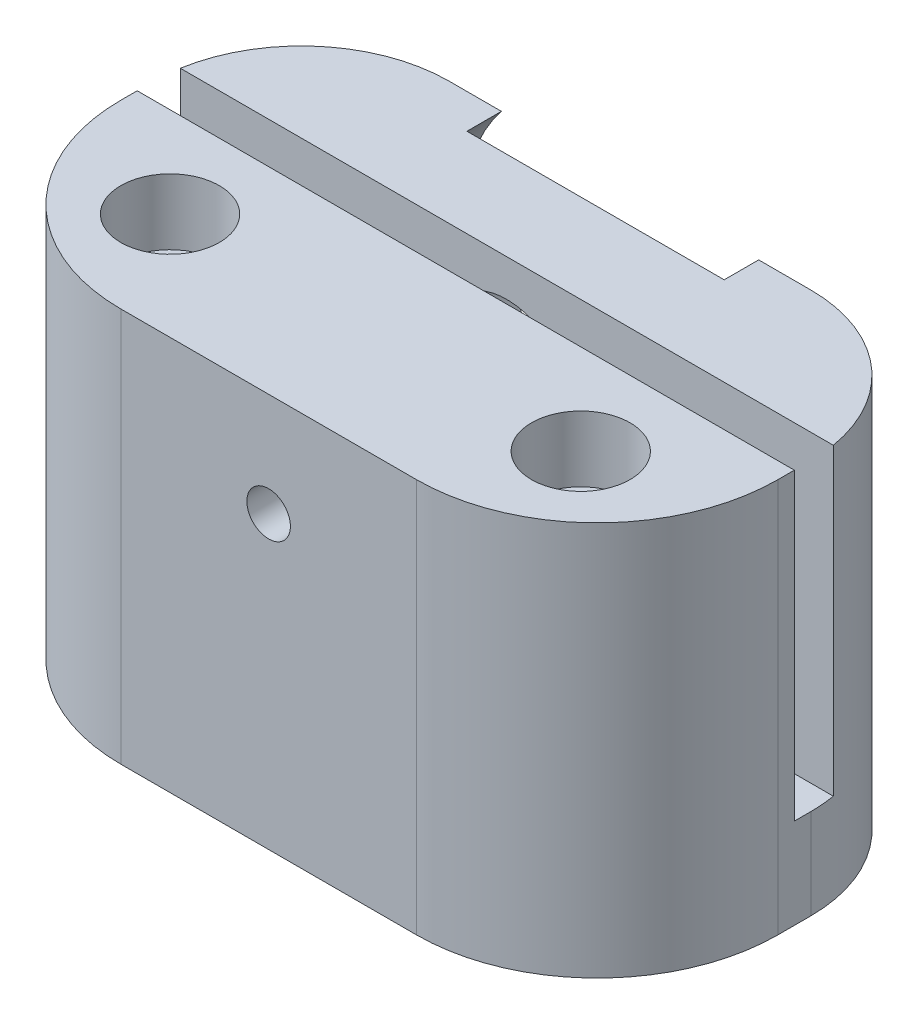
ISO-10303-21;
HEADER;
FILE_DESCRIPTION(('STEP AP214'),'2;1');
FILE_NAME('part.step','',(''),(''),'','','');
FILE_SCHEMA(('AUTOMOTIVE_DESIGN { 1 0 10303 214 1 1 1 1 }'));
ENDSEC;
DATA;
#1=APPLICATION_CONTEXT('core data for automotive mechanical design processes');
#2=APPLICATION_PROTOCOL_DEFINITION('international standard','automotive_design',2000,#1);
#3=PRODUCT_CONTEXT('',#1,'mechanical');
#4=PRODUCT('Part','Part','',(#3));
#5=PRODUCT_RELATED_PRODUCT_CATEGORY('part','',(#4));
#6=PRODUCT_DEFINITION_FORMATION('','',#4);
#7=PRODUCT_DEFINITION_CONTEXT('part definition',#1,'design');
#8=PRODUCT_DEFINITION('design','',#6,#7);
#9=PRODUCT_DEFINITION_SHAPE('','',#8);
#10=(LENGTH_UNIT() NAMED_UNIT(*) SI_UNIT(.MILLI.,.METRE.));
#11=(NAMED_UNIT(*) PLANE_ANGLE_UNIT() SI_UNIT($,.RADIAN.));
#12=(NAMED_UNIT(*) SI_UNIT($,.STERADIAN.) SOLID_ANGLE_UNIT());
#13=UNCERTAINTY_MEASURE_WITH_UNIT(LENGTH_MEASURE(1.E-05),#10,'distance_accuracy_value','');
#14=(GEOMETRIC_REPRESENTATION_CONTEXT(3) GLOBAL_UNCERTAINTY_ASSIGNED_CONTEXT((#13)) GLOBAL_UNIT_ASSIGNED_CONTEXT((#10,
#11,#12)) REPRESENTATION_CONTEXT('',''));
#15=CARTESIAN_POINT('',(0.,0.,0.));
#16=DIRECTION('',(0.,0.,1.));
#17=DIRECTION('',(1.,0.,0.));
#18=AXIS2_PLACEMENT_3D('',#15,#16,#17);
#19=CARTESIAN_POINT('',(20.,17.7,-16.5));
#20=DIRECTION('',(0.,0.,-1.));
#21=DIRECTION('',(-1.,0.,0.));
#22=AXIS2_PLACEMENT_3D('',#19,#20,#21);
#23=CYLINDRICAL_SURFACE('',#22,4.8);
#24=CARTESIAN_POINT('',(20.,17.7,-16.5));
#25=DIRECTION('',(0.,0.,-1.));
#26=DIRECTION('',(-1.,0.,0.));
#27=AXIS2_PLACEMENT_3D('',#24,#25,#26);
#28=CIRCLE('',#27,4.8);
#29=CARTESIAN_POINT('',(15.2,17.7,-16.5));
#30=VERTEX_POINT('',#29);
#31=EDGE_CURVE('E240',#30,#30,#28,.T.);
#32=ORIENTED_EDGE('',*,*,#31,.F.);
#33=EDGE_LOOP('',(#32));
#34=FACE_BOUND('',#33,.T.);
#35=CARTESIAN_POINT('',(20.,17.7,-19.9));
#36=DIRECTION('',(0.,0.,-1.));
#37=DIRECTION('',(-1.,0.,0.));
#38=AXIS2_PLACEMENT_3D('',#35,#36,#37);
#39=CIRCLE('',#38,4.8);
#40=CARTESIAN_POINT('',(15.2,17.7,-19.9));
#41=VERTEX_POINT('',#40);
#42=EDGE_CURVE('E241',#41,#41,#39,.F.);
#43=ORIENTED_EDGE('',*,*,#42,.F.);
#44=EDGE_LOOP('',(#43));
#45=FACE_BOUND('',#44,.T.);
#46=ADVANCED_FACE('F37',(#34,#45),#23,.F.);
#47=CARTESIAN_POINT('',(20.,17.7,-29.));
#48=DIRECTION('',(0.,0.,1.));
#49=DIRECTION('',(1.,0.,0.));
#50=AXIS2_PLACEMENT_3D('',#47,#48,#49);
#51=CYLINDRICAL_SURFACE('',#50,4.05);
#52=CARTESIAN_POINT('',(20.,17.7,-14.5));
#53=DIRECTION('',(0.,0.,-1.));
#54=DIRECTION('',(-1.,0.,0.));
#55=AXIS2_PLACEMENT_3D('',#52,#53,#54);
#56=CIRCLE('',#55,4.05);
#57=CARTESIAN_POINT('',(15.95,17.7,-14.5));
#58=VERTEX_POINT('',#57);
#59=EDGE_CURVE('E233',#58,#58,#56,.F.);
#60=ORIENTED_EDGE('',*,*,#59,.T.);
#61=EDGE_LOOP('',(#60));
#62=FACE_BOUND('',#61,.T.);
#63=CARTESIAN_POINT('',(20.,17.7,-16.5));
#64=DIRECTION('',(0.,0.,-1.));
#65=DIRECTION('',(-1.,0.,0.));
#66=AXIS2_PLACEMENT_3D('',#63,#64,#65);
#67=CIRCLE('',#66,4.05);
#68=CARTESIAN_POINT('',(15.95,17.7,-16.5));
#69=VERTEX_POINT('',#68);
#70=EDGE_CURVE('E237',#69,#69,#67,.T.);
#71=ORIENTED_EDGE('',*,*,#70,.T.);
#72=EDGE_LOOP('',(#71));
#73=FACE_BOUND('',#72,.T.);
#74=ADVANCED_FACE('F336',(#62,#73),#51,.F.);
#75=CARTESIAN_POINT('',(40.,5.5,-22.));
#76=DIRECTION('',(0.,-1.,0.));
#77=DIRECTION('',(1.,0.,0.));
#78=AXIS2_PLACEMENT_3D('',#75,#76,#77);
#79=PLANE('',#78);
#80=DIRECTION('',(1.,0.,0.));
#81=VECTOR('',#80,1.);
#82=CARTESIAN_POINT('',(40.,5.5,-14.5));
#83=LINE('',#82,#81);
#84=CARTESIAN_POINT('',(0.125880325350576,5.5,-14.5));
#85=VERTEX_POINT('',#84);
#86=CARTESIAN_POINT('',(39.8741196746494,5.5,-14.5));
#87=VERTEX_POINT('',#86);
#88=EDGE_CURVE('E167',#85,#87,#83,.T.);
#89=ORIENTED_EDGE('',*,*,#88,.F.);
#90=CARTESIAN_POINT('',(9.,5.5,-13.));
#91=DIRECTION('',(0.,-1.,0.));
#92=DIRECTION('',(1.,0.,0.));
#93=AXIS2_PLACEMENT_3D('',#90,#91,#92);
#94=CIRCLE('',#93,9.);
#95=CARTESIAN_POINT('',(0.,5.5,-13.));
#96=VERTEX_POINT('',#95);
#97=EDGE_CURVE('E278',#85,#96,#94,.F.);
#98=ORIENTED_EDGE('',*,*,#97,.T.);
#99=DIRECTION('',(0.,0.,1.));
#100=VECTOR('',#99,1.);
#101=CARTESIAN_POINT('',(0.,5.5,-22.));
#102=LINE('',#101,#100);
#103=CARTESIAN_POINT('',(0.,5.5,-12.));
#104=VERTEX_POINT('',#103);
#105=EDGE_CURVE('E185',#96,#104,#102,.T.);
#106=ORIENTED_EDGE('',*,*,#105,.T.);
#107=DIRECTION('',(1.,0.,0.));
#108=VECTOR('',#107,1.);
#109=CARTESIAN_POINT('',(40.,5.5,-12.));
#110=LINE('',#109,#108);
#111=CARTESIAN_POINT('',(40.,5.5,-12.));
#112=VERTEX_POINT('',#111);
#113=EDGE_CURVE('E177',#104,#112,#110,.T.);
#114=ORIENTED_EDGE('',*,*,#113,.T.);
#115=DIRECTION('',(0.,0.,1.));
#116=VECTOR('',#115,1.);
#117=CARTESIAN_POINT('',(40.,5.5,-22.));
#118=LINE('',#117,#116);
#119=CARTESIAN_POINT('',(40.,5.5,-13.));
#120=VERTEX_POINT('',#119);
#121=EDGE_CURVE('E181',#120,#112,#118,.T.);
#122=ORIENTED_EDGE('',*,*,#121,.F.);
#123=CARTESIAN_POINT('',(31.,5.5,-13.));
#124=DIRECTION('',(0.,-1.,0.));
#125=DIRECTION('',(1.,0.,0.));
#126=AXIS2_PLACEMENT_3D('',#123,#124,#125);
#127=CIRCLE('',#126,9.);
#128=EDGE_CURVE('E276',#120,#87,#127,.F.);
#129=ORIENTED_EDGE('',*,*,#128,.T.);
#130=EDGE_LOOP('',(#89,#98,#106,#114,#122,#129));
#131=FACE_BOUND('',#130,.T.);
#132=ADVANCED_FACE('F302',(#131),#79,.F.);
#133=CARTESIAN_POINT('',(0.,24.,-12.));
#134=DIRECTION('',(0.,0.,1.));
#135=DIRECTION('',(1.,0.,0.));
#136=AXIS2_PLACEMENT_3D('',#133,#134,#135);
#137=PLANE('',#136);
#138=CARTESIAN_POINT('',(20.,17.7,-12.));
#139=DIRECTION('',(0.,0.,1.));
#140=DIRECTION('',(1.,0.,0.));
#141=AXIS2_PLACEMENT_3D('',#138,#139,#140);
#142=CIRCLE('',#141,4.05);
#143=CARTESIAN_POINT('',(24.05,17.7,-12.));
#144=VERTEX_POINT('',#143);
#145=EDGE_CURVE('E171',#144,#144,#142,.F.);
#146=ORIENTED_EDGE('',*,*,#145,.F.);
#147=EDGE_LOOP('',(#146));
#148=FACE_BOUND('',#147,.T.);
#149=ORIENTED_EDGE('',*,*,#113,.F.);
#150=DIRECTION('',(0.,-1.,0.));
#151=VECTOR('',#150,1.);
#152=CARTESIAN_POINT('',(0.,24.,-12.));
#153=LINE('',#152,#151);
#154=CARTESIAN_POINT('',(0.,24.,-12.));
#155=VERTEX_POINT('',#154);
#156=EDGE_CURVE('E218',#155,#104,#153,.T.);
#157=ORIENTED_EDGE('',*,*,#156,.F.);
#158=DIRECTION('',(-1.,0.,0.));
#159=VECTOR('',#158,1.);
#160=CARTESIAN_POINT('',(0.,24.,-12.));
#161=LINE('',#160,#159);
#162=CARTESIAN_POINT('',(40.,24.,-12.));
#163=VERTEX_POINT('',#162);
#164=EDGE_CURVE('E216',#163,#155,#161,.T.);
#165=ORIENTED_EDGE('',*,*,#164,.F.);
#166=DIRECTION('',(0.,-1.,0.));
#167=VECTOR('',#166,1.);
#168=CARTESIAN_POINT('',(40.,24.,-12.));
#169=LINE('',#168,#167);
#170=EDGE_CURVE('E159',#163,#112,#169,.T.);
#171=ORIENTED_EDGE('',*,*,#170,.T.);
#172=EDGE_LOOP('',(#149,#157,#165,#171));
#173=FACE_BOUND('',#172,.T.);
#174=ADVANCED_FACE('F306',(#148,#173),#137,.F.);
#175=CARTESIAN_POINT('',(0.,24.,0.));
#176=DIRECTION('',(1.,0.,0.));
#177=DIRECTION('',(0.,0.,-1.));
#178=AXIS2_PLACEMENT_3D('',#175,#176,#177);
#179=PLANE('',#178);
#180=ORIENTED_EDGE('',*,*,#105,.F.);
#181=DIRECTION('',(0.,1.,0.));
#182=VECTOR('',#181,1.);
#183=CARTESIAN_POINT('',(0.,24.,-13.));
#184=LINE('',#183,#182);
#185=CARTESIAN_POINT('',(0.,0.,-13.));
#186=VERTEX_POINT('',#185);
#187=EDGE_CURVE('E60',#96,#186,#184,.F.);
#188=ORIENTED_EDGE('',*,*,#187,.T.);
#189=DIRECTION('',(0.,0.,1.));
#190=VECTOR('',#189,1.);
#191=CARTESIAN_POINT('',(0.,0.,0.));
#192=LINE('',#191,#190);
#193=CARTESIAN_POINT('',(0.,0.,-11.));
#194=VERTEX_POINT('',#193);
#195=EDGE_CURVE('E219',#186,#194,#192,.T.);
#196=ORIENTED_EDGE('',*,*,#195,.T.);
#197=DIRECTION('',(0.,-1.,0.));
#198=VECTOR('',#197,1.);
#199=CARTESIAN_POINT('',(0.,24.,-11.));
#200=LINE('',#199,#198);
#201=CARTESIAN_POINT('',(0.,24.,-11.));
#202=VERTEX_POINT('',#201);
#203=EDGE_CURVE('E255',#194,#202,#200,.F.);
#204=ORIENTED_EDGE('',*,*,#203,.T.);
#205=DIRECTION('',(0.,0.,1.));
#206=VECTOR('',#205,1.);
#207=CARTESIAN_POINT('',(0.,24.,0.));
#208=LINE('',#207,#206);
#209=EDGE_CURVE('E207',#155,#202,#208,.T.);
#210=ORIENTED_EDGE('',*,*,#209,.F.);
#211=ORIENTED_EDGE('',*,*,#156,.T.);
#212=EDGE_LOOP('',(#180,#188,#196,#204,#210,#211));
#213=FACE_BOUND('',#212,.T.);
#214=ADVANCED_FACE('F309',(#213),#179,.F.);
#215=CARTESIAN_POINT('',(0.,24.,0.));
#216=DIRECTION('',(0.,0.,-1.));
#217=DIRECTION('',(-1.,0.,0.));
#218=AXIS2_PLACEMENT_3D('',#215,#216,#217);
#219=PLANE('',#218);
#220=CARTESIAN_POINT('',(20.,17.7,0.));
#221=DIRECTION('',(0.,0.,-1.));
#222=DIRECTION('',(-1.,0.,0.));
#223=AXIS2_PLACEMENT_3D('',#220,#221,#222);
#224=CIRCLE('',#223,1.325);
#225=CARTESIAN_POINT('',(18.675,17.7,0.));
#226=VERTEX_POINT('',#225);
#227=EDGE_CURVE('E152',#226,#226,#224,.T.);
#228=ORIENTED_EDGE('',*,*,#227,.T.);
#229=EDGE_LOOP('',(#228));
#230=FACE_BOUND('',#229,.T.);
#231=DIRECTION('',(1.,0.,0.));
#232=VECTOR('',#231,1.);
#233=CARTESIAN_POINT('',(0.,24.,0.));
#234=LINE('',#233,#232);
#235=CARTESIAN_POINT('',(11.,24.,0.));
#236=VERTEX_POINT('',#235);
#237=CARTESIAN_POINT('',(29.,24.,0.));
#238=VERTEX_POINT('',#237);
#239=EDGE_CURVE('E210',#236,#238,#234,.T.);
#240=ORIENTED_EDGE('',*,*,#239,.F.);
#241=DIRECTION('',(0.,-1.,0.));
#242=VECTOR('',#241,1.);
#243=CARTESIAN_POINT('',(11.,24.,0.));
#244=LINE('',#243,#242);
#245=CARTESIAN_POINT('',(11.,0.,0.));
#246=VERTEX_POINT('',#245);
#247=EDGE_CURVE('E247',#236,#246,#244,.T.);
#248=ORIENTED_EDGE('',*,*,#247,.T.);
#249=DIRECTION('',(1.,0.,0.));
#250=VECTOR('',#249,1.);
#251=CARTESIAN_POINT('',(0.,0.,0.));
#252=LINE('',#251,#250);
#253=CARTESIAN_POINT('',(29.,0.,0.));
#254=VERTEX_POINT('',#253);
#255=EDGE_CURVE('E221',#246,#254,#252,.T.);
#256=ORIENTED_EDGE('',*,*,#255,.T.);
#257=DIRECTION('',(0.,-1.,0.));
#258=VECTOR('',#257,1.);
#259=CARTESIAN_POINT('',(29.,24.,0.));
#260=LINE('',#259,#258);
#261=EDGE_CURVE('E245',#254,#238,#260,.F.);
#262=ORIENTED_EDGE('',*,*,#261,.T.);
#263=EDGE_LOOP('',(#240,#248,#256,#262));
#264=FACE_BOUND('',#263,.T.);
#265=ADVANCED_FACE('F320',(#230,#264),#219,.F.);
#266=CARTESIAN_POINT('',(40.,24.,0.));
#267=DIRECTION('',(-1.,0.,0.));
#268=DIRECTION('',(0.,0.,1.));
#269=AXIS2_PLACEMENT_3D('',#266,#267,#268);
#270=PLANE('',#269);
#271=DIRECTION('',(0.,0.,-1.));
#272=VECTOR('',#271,1.);
#273=CARTESIAN_POINT('',(40.,0.,0.));
#274=LINE('',#273,#272);
#275=CARTESIAN_POINT('',(40.,0.,-11.));
#276=VERTEX_POINT('',#275);
#277=CARTESIAN_POINT('',(40.,0.,-13.));
#278=VERTEX_POINT('',#277);
#279=EDGE_CURVE('E211',#276,#278,#274,.T.);
#280=ORIENTED_EDGE('',*,*,#279,.T.);
#281=DIRECTION('',(0.,-1.,0.));
#282=VECTOR('',#281,1.);
#283=CARTESIAN_POINT('',(40.,24.,-13.));
#284=LINE('',#283,#282);
#285=EDGE_CURVE('E12',#278,#120,#284,.F.);
#286=ORIENTED_EDGE('',*,*,#285,.T.);
#287=ORIENTED_EDGE('',*,*,#121,.T.);
#288=ORIENTED_EDGE('',*,*,#170,.F.);
#289=DIRECTION('',(0.,0.,-1.));
#290=VECTOR('',#289,1.);
#291=CARTESIAN_POINT('',(40.,24.,0.));
#292=LINE('',#291,#290);
#293=CARTESIAN_POINT('',(40.,24.,-11.));
#294=VERTEX_POINT('',#293);
#295=EDGE_CURVE('E214',#294,#163,#292,.T.);
#296=ORIENTED_EDGE('',*,*,#295,.F.);
#297=DIRECTION('',(0.,-1.,0.));
#298=VECTOR('',#297,1.);
#299=CARTESIAN_POINT('',(40.,24.,-11.));
#300=LINE('',#299,#298);
#301=EDGE_CURVE('E261',#294,#276,#300,.T.);
#302=ORIENTED_EDGE('',*,*,#301,.T.);
#303=EDGE_LOOP('',(#280,#286,#287,#288,#296,#302));
#304=FACE_BOUND('',#303,.T.);
#305=ADVANCED_FACE('F299',(#304),#270,.F.);
#306=CARTESIAN_POINT('',(0.,24.,0.));
#307=DIRECTION('',(0.,-1.,0.));
#308=DIRECTION('',(0.,0.,-1.));
#309=AXIS2_PLACEMENT_3D('',#306,#307,#308);
#310=PLANE('',#309);
#311=CARTESIAN_POINT('',(7.5,24.,-6.5));
#312=DIRECTION('',(0.,1.,0.));
#313=DIRECTION('',(0.,0.,1.));
#314=AXIS2_PLACEMENT_3D('',#311,#312,#313);
#315=CIRCLE('',#314,3.);
#316=CARTESIAN_POINT('',(7.5,24.,-3.5));
#317=VERTEX_POINT('',#316);
#318=EDGE_CURVE('E187',#317,#317,#315,.T.);
#319=ORIENTED_EDGE('',*,*,#318,.F.);
#320=EDGE_LOOP('',(#319));
#321=FACE_BOUND('',#320,.T.);
#322=CARTESIAN_POINT('',(32.5,24.,-6.5));
#323=DIRECTION('',(0.,1.,0.));
#324=DIRECTION('',(0.,0.,1.));
#325=AXIS2_PLACEMENT_3D('',#322,#323,#324);
#326=CIRCLE('',#325,3.);
#327=CARTESIAN_POINT('',(32.5,24.,-3.5));
#328=VERTEX_POINT('',#327);
#329=EDGE_CURVE('E197',#328,#328,#326,.T.);
#330=ORIENTED_EDGE('',*,*,#329,.F.);
#331=EDGE_LOOP('',(#330));
#332=FACE_BOUND('',#331,.T.);
#333=ORIENTED_EDGE('',*,*,#209,.T.);
#334=CARTESIAN_POINT('',(11.,24.,-11.));
#335=DIRECTION('',(0.,-1.,0.));
#336=DIRECTION('',(0.,0.,-1.));
#337=AXIS2_PLACEMENT_3D('',#334,#335,#336);
#338=CIRCLE('',#337,11.);
#339=EDGE_CURVE('E259',#202,#236,#338,.F.);
#340=ORIENTED_EDGE('',*,*,#339,.T.);
#341=ORIENTED_EDGE('',*,*,#239,.T.);
#342=CARTESIAN_POINT('',(29.,24.,-11.));
#343=DIRECTION('',(0.,-1.,0.));
#344=DIRECTION('',(0.,0.,-1.));
#345=AXIS2_PLACEMENT_3D('',#342,#343,#344);
#346=CIRCLE('',#345,11.);
#347=EDGE_CURVE('E257',#238,#294,#346,.F.);
#348=ORIENTED_EDGE('',*,*,#347,.T.);
#349=ORIENTED_EDGE('',*,*,#295,.T.);
#350=ORIENTED_EDGE('',*,*,#164,.T.);
#351=EDGE_LOOP('',(#333,#340,#341,#348,#349,#350));
#352=FACE_BOUND('',#351,.T.);
#353=ADVANCED_FACE('F313',(#321,#332,#352),#310,.F.);
#354=CARTESIAN_POINT('',(0.,0.,0.));
#355=DIRECTION('',(0.,-1.,0.));
#356=DIRECTION('',(0.,0.,-1.));
#357=AXIS2_PLACEMENT_3D('',#354,#355,#356);
#358=PLANE('',#357);
#359=CARTESIAN_POINT('',(7.5,0.,-6.5));
#360=DIRECTION('',(0.,-1.,0.));
#361=DIRECTION('',(0.,0.,-1.));
#362=AXIS2_PLACEMENT_3D('',#359,#360,#361);
#363=CIRCLE('',#362,1.49999999999999);
#364=CARTESIAN_POINT('',(7.5,0.,-7.99999999999999));
#365=VERTEX_POINT('',#364);
#366=EDGE_CURVE('E196',#365,#365,#363,.T.);
#367=ORIENTED_EDGE('',*,*,#366,.F.);
#368=EDGE_LOOP('',(#367));
#369=FACE_BOUND('',#368,.T.);
#370=CARTESIAN_POINT('',(32.5,0.,-6.5));
#371=DIRECTION('',(0.,-1.,0.));
#372=DIRECTION('',(0.,0.,-1.));
#373=AXIS2_PLACEMENT_3D('',#370,#371,#372);
#374=CIRCLE('',#373,1.49999999999999);
#375=CARTESIAN_POINT('',(32.5,0.,-7.99999999999999));
#376=VERTEX_POINT('',#375);
#377=EDGE_CURVE('E206',#376,#376,#374,.T.);
#378=ORIENTED_EDGE('',*,*,#377,.F.);
#379=EDGE_LOOP('',(#378));
#380=FACE_BOUND('',#379,.T.);
#381=ORIENTED_EDGE('',*,*,#195,.F.);
#382=CARTESIAN_POINT('',(9.,0.,-13.));
#383=DIRECTION('',(0.,-1.,0.));
#384=DIRECTION('',(0.,0.,-1.));
#385=AXIS2_PLACEMENT_3D('',#382,#383,#384);
#386=CIRCLE('',#385,9.);
#387=CARTESIAN_POINT('',(9.,0.,-22.));
#388=VERTEX_POINT('',#387);
#389=EDGE_CURVE('E45',#186,#388,#386,.T.);
#390=ORIENTED_EDGE('',*,*,#389,.T.);
#391=DIRECTION('',(-1.,0.,0.));
#392=VECTOR('',#391,1.);
#393=CARTESIAN_POINT('',(40.,0.,-22.));
#394=LINE('',#393,#392);
#395=CARTESIAN_POINT('',(31.,0.,-22.));
#396=VERTEX_POINT('',#395);
#397=EDGE_CURVE('E179',#396,#388,#394,.T.);
#398=ORIENTED_EDGE('',*,*,#397,.F.);
#399=CARTESIAN_POINT('',(31.,0.,-13.));
#400=DIRECTION('',(0.,-1.,0.));
#401=DIRECTION('',(0.,0.,-1.));
#402=AXIS2_PLACEMENT_3D('',#399,#400,#401);
#403=CIRCLE('',#402,9.);
#404=EDGE_CURVE('E52',#396,#278,#403,.T.);
#405=ORIENTED_EDGE('',*,*,#404,.T.);
#406=ORIENTED_EDGE('',*,*,#279,.F.);
#407=CARTESIAN_POINT('',(29.,0.,-11.));
#408=DIRECTION('',(0.,-1.,0.));
#409=DIRECTION('',(0.,0.,-1.));
#410=AXIS2_PLACEMENT_3D('',#407,#408,#409);
#411=CIRCLE('',#410,11.);
#412=EDGE_CURVE('E250',#276,#254,#411,.T.);
#413=ORIENTED_EDGE('',*,*,#412,.T.);
#414=ORIENTED_EDGE('',*,*,#255,.F.);
#415=CARTESIAN_POINT('',(11.,0.,-11.));
#416=DIRECTION('',(0.,-1.,0.));
#417=DIRECTION('',(0.,0.,-1.));
#418=AXIS2_PLACEMENT_3D('',#415,#416,#417);
#419=CIRCLE('',#418,11.);
#420=EDGE_CURVE('E252',#246,#194,#419,.T.);
#421=ORIENTED_EDGE('',*,*,#420,.T.);
#422=EDGE_LOOP('',(#381,#390,#398,#405,#406,#413,#414,#421));
#423=FACE_BOUND('',#422,.T.);
#424=ADVANCED_FACE('F282',(#369,#380,#423),#358,.T.);
#425=CARTESIAN_POINT('',(32.5,24.,-6.5));
#426=DIRECTION('',(0.,1.,0.));
#427=DIRECTION('',(0.,0.,1.));
#428=AXIS2_PLACEMENT_3D('',#425,#426,#427);
#429=CYLINDRICAL_SURFACE('',#428,1.49999999999999);
#430=ORIENTED_EDGE('',*,*,#377,.T.);
#431=EDGE_LOOP('',(#430));
#432=FACE_BOUND('',#431,.T.);
#433=CARTESIAN_POINT('',(32.5,20.,-6.5));
#434=DIRECTION('',(0.,1.,0.));
#435=DIRECTION('',(0.,0.,1.));
#436=AXIS2_PLACEMENT_3D('',#433,#434,#435);
#437=CIRCLE('',#436,1.49999999999999);
#438=CARTESIAN_POINT('',(32.5,20.,-5.00000000000001));
#439=VERTEX_POINT('',#438);
#440=EDGE_CURVE('E203',#439,#439,#437,.T.);
#441=ORIENTED_EDGE('',*,*,#440,.T.);
#442=EDGE_LOOP('',(#441));
#443=FACE_BOUND('',#442,.T.);
#444=ADVANCED_FACE('F385',(#432,#443),#429,.F.);
#445=CARTESIAN_POINT('',(34.,20.,-6.5));
#446=DIRECTION('',(0.,-1.,0.));
#447=DIRECTION('',(0.,0.,-1.));
#448=AXIS2_PLACEMENT_3D('',#445,#446,#447);
#449=PLANE('',#448);
#450=ORIENTED_EDGE('',*,*,#440,.F.);
#451=EDGE_LOOP('',(#450));
#452=FACE_BOUND('',#451,.T.);
#453=CARTESIAN_POINT('',(32.5,20.,-6.5));
#454=DIRECTION('',(0.,1.,0.));
#455=DIRECTION('',(0.,0.,1.));
#456=AXIS2_PLACEMENT_3D('',#453,#454,#455);
#457=CIRCLE('',#456,3.);
#458=CARTESIAN_POINT('',(32.5,20.,-3.5));
#459=VERTEX_POINT('',#458);
#460=EDGE_CURVE('E200',#459,#459,#457,.T.);
#461=ORIENTED_EDGE('',*,*,#460,.T.);
#462=EDGE_LOOP('',(#461));
#463=FACE_BOUND('',#462,.T.);
#464=ADVANCED_FACE('F381',(#452,#463),#449,.F.);
#465=CARTESIAN_POINT('',(32.5,24.,-6.5));
#466=DIRECTION('',(0.,1.,0.));
#467=DIRECTION('',(0.,0.,1.));
#468=AXIS2_PLACEMENT_3D('',#465,#466,#467);
#469=CYLINDRICAL_SURFACE('',#468,3.);
#470=ORIENTED_EDGE('',*,*,#460,.F.);
#471=EDGE_LOOP('',(#470));
#472=FACE_BOUND('',#471,.T.);
#473=ORIENTED_EDGE('',*,*,#329,.T.);
#474=EDGE_LOOP('',(#473));
#475=FACE_BOUND('',#474,.T.);
#476=ADVANCED_FACE('F377',(#472,#475),#469,.F.);
#477=CARTESIAN_POINT('',(7.5,24.,-6.5));
#478=DIRECTION('',(0.,1.,0.));
#479=DIRECTION('',(0.,0.,1.));
#480=AXIS2_PLACEMENT_3D('',#477,#478,#479);
#481=CYLINDRICAL_SURFACE('',#480,1.49999999999999);
#482=ORIENTED_EDGE('',*,*,#366,.T.);
#483=EDGE_LOOP('',(#482));
#484=FACE_BOUND('',#483,.T.);
#485=CARTESIAN_POINT('',(7.5,20.,-6.5));
#486=DIRECTION('',(0.,1.,0.));
#487=DIRECTION('',(0.,0.,1.));
#488=AXIS2_PLACEMENT_3D('',#485,#486,#487);
#489=CIRCLE('',#488,1.49999999999999);
#490=CARTESIAN_POINT('',(7.5,20.,-5.00000000000001));
#491=VERTEX_POINT('',#490);
#492=EDGE_CURVE('E193',#491,#491,#489,.T.);
#493=ORIENTED_EDGE('',*,*,#492,.T.);
#494=EDGE_LOOP('',(#493));
#495=FACE_BOUND('',#494,.T.);
#496=ADVANCED_FACE('F373',(#484,#495),#481,.F.);
#497=CARTESIAN_POINT('',(8.99999999999999,20.,-6.5));
#498=DIRECTION('',(0.,-1.,0.));
#499=DIRECTION('',(0.,0.,-1.));
#500=AXIS2_PLACEMENT_3D('',#497,#498,#499);
#501=PLANE('',#500);
#502=ORIENTED_EDGE('',*,*,#492,.F.);
#503=EDGE_LOOP('',(#502));
#504=FACE_BOUND('',#503,.T.);
#505=CARTESIAN_POINT('',(7.5,20.,-6.5));
#506=DIRECTION('',(0.,1.,0.));
#507=DIRECTION('',(0.,0.,1.));
#508=AXIS2_PLACEMENT_3D('',#505,#506,#507);
#509=CIRCLE('',#508,3.);
#510=CARTESIAN_POINT('',(7.5,20.,-3.5));
#511=VERTEX_POINT('',#510);
#512=EDGE_CURVE('E190',#511,#511,#509,.T.);
#513=ORIENTED_EDGE('',*,*,#512,.T.);
#514=EDGE_LOOP('',(#513));
#515=FACE_BOUND('',#514,.T.);
#516=ADVANCED_FACE('F369',(#504,#515),#501,.F.);
#517=CARTESIAN_POINT('',(7.5,24.,-6.5));
#518=DIRECTION('',(0.,1.,0.));
#519=DIRECTION('',(0.,0.,1.));
#520=AXIS2_PLACEMENT_3D('',#517,#518,#519);
#521=CYLINDRICAL_SURFACE('',#520,3.);
#522=ORIENTED_EDGE('',*,*,#512,.F.);
#523=EDGE_LOOP('',(#522));
#524=FACE_BOUND('',#523,.T.);
#525=ORIENTED_EDGE('',*,*,#318,.T.);
#526=EDGE_LOOP('',(#525));
#527=FACE_BOUND('',#526,.T.);
#528=ADVANCED_FACE('F364',(#524,#527),#521,.F.);
#529=CARTESIAN_POINT('',(0.,0.,-22.));
#530=DIRECTION('',(0.,0.,1.));
#531=DIRECTION('',(1.,0.,0.));
#532=AXIS2_PLACEMENT_3D('',#529,#530,#531);
#533=PLANE('',#532);
#534=ORIENTED_EDGE('',*,*,#397,.T.);
#535=DIRECTION('',(0.,1.,0.));
#536=VECTOR('',#535,1.);
#537=CARTESIAN_POINT('',(9.,0.,-22.));
#538=LINE('',#537,#536);
#539=CARTESIAN_POINT('',(9.,24.,-22.));
#540=VERTEX_POINT('',#539);
#541=EDGE_CURVE('E165',#388,#540,#538,.T.);
#542=ORIENTED_EDGE('',*,*,#541,.T.);
#543=DIRECTION('',(-1.,0.,0.));
#544=VECTOR('',#543,1.);
#545=CARTESIAN_POINT('',(40.,24.,-22.));
#546=LINE('',#545,#544);
#547=CARTESIAN_POINT('',(12.1697701183171,24.,-22.));
#548=VERTEX_POINT('',#547);
#549=EDGE_CURVE('E157',#548,#540,#546,.T.);
#550=ORIENTED_EDGE('',*,*,#549,.F.);
#551=CARTESIAN_POINT('',(20.,17.7,-22.));
#552=DIRECTION('',(0.,0.,-1.));
#553=DIRECTION('',(-1.,0.,0.));
#554=AXIS2_PLACEMENT_3D('',#551,#552,#553);
#555=CIRCLE('',#554,10.05);
#556=CARTESIAN_POINT('',(27.8302298816829,24.,-22.));
#557=VERTEX_POINT('',#556);
#558=EDGE_CURVE('E140',#557,#548,#555,.T.);
#559=ORIENTED_EDGE('',*,*,#558,.F.);
#560=CARTESIAN_POINT('',(31.,24.,-22.));
#561=VERTEX_POINT('',#560);
#562=EDGE_CURVE('E166',#561,#557,#546,.T.);
#563=ORIENTED_EDGE('',*,*,#562,.F.);
#564=DIRECTION('',(0.,-1.,0.));
#565=VECTOR('',#564,1.);
#566=CARTESIAN_POINT('',(31.,0.,-22.));
#567=LINE('',#566,#565);
#568=EDGE_CURVE('E264',#561,#396,#567,.T.);
#569=ORIENTED_EDGE('',*,*,#568,.T.);
#570=EDGE_LOOP('',(#534,#542,#550,#559,#563,#569));
#571=FACE_BOUND('',#570,.T.);
#572=ADVANCED_FACE('F163',(#571),#533,.F.);
#573=CARTESIAN_POINT('',(40.,24.,-14.5));
#574=DIRECTION('',(0.,0.,-1.));
#575=DIRECTION('',(-1.,0.,0.));
#576=AXIS2_PLACEMENT_3D('',#573,#574,#575);
#577=PLANE('',#576);
#578=ORIENTED_EDGE('',*,*,#59,.F.);
#579=EDGE_LOOP('',(#578));
#580=FACE_BOUND('',#579,.T.);
#581=DIRECTION('',(1.,0.,0.));
#582=VECTOR('',#581,1.);
#583=CARTESIAN_POINT('',(40.,24.,-14.5));
#584=LINE('',#583,#582);
#585=CARTESIAN_POINT('',(0.125880325350582,24.,-14.5));
#586=VERTEX_POINT('',#585);
#587=CARTESIAN_POINT('',(39.8741196746494,24.,-14.5));
#588=VERTEX_POINT('',#587);
#589=EDGE_CURVE('E169',#586,#588,#584,.T.);
#590=ORIENTED_EDGE('',*,*,#589,.F.);
#591=DIRECTION('',(0.,1.,0.));
#592=VECTOR('',#591,1.);
#593=CARTESIAN_POINT('',(0.125880325350578,24.,-14.5));
#594=LINE('',#593,#592);
#595=EDGE_CURVE('E274',#586,#85,#594,.F.);
#596=ORIENTED_EDGE('',*,*,#595,.T.);
#597=ORIENTED_EDGE('',*,*,#88,.T.);
#598=DIRECTION('',(0.,-1.,0.));
#599=VECTOR('',#598,1.);
#600=CARTESIAN_POINT('',(39.8741196746494,5.5,-14.5));
#601=LINE('',#600,#599);
#602=EDGE_CURVE('E272',#87,#588,#601,.F.);
#603=ORIENTED_EDGE('',*,*,#602,.T.);
#604=EDGE_LOOP('',(#590,#596,#597,#603));
#605=FACE_BOUND('',#604,.T.);
#606=ADVANCED_FACE('F291',(#580,#605),#577,.F.);
#607=CARTESIAN_POINT('',(0.,24.,0.));
#608=DIRECTION('',(0.,1.,0.));
#609=DIRECTION('',(-1.,0.,0.));
#610=AXIS2_PLACEMENT_3D('',#607,#608,#609);
#611=PLANE('',#610);
#612=ORIENTED_EDGE('',*,*,#549,.T.);
#613=CARTESIAN_POINT('',(9.,24.,-13.));
#614=DIRECTION('',(0.,1.,0.));
#615=DIRECTION('',(-1.,0.,0.));
#616=AXIS2_PLACEMENT_3D('',#613,#614,#615);
#617=CIRCLE('',#616,9.);
#618=EDGE_CURVE('E270',#540,#586,#617,.T.);
#619=ORIENTED_EDGE('',*,*,#618,.T.);
#620=ORIENTED_EDGE('',*,*,#589,.T.);
#621=CARTESIAN_POINT('',(31.,24.,-13.));
#622=DIRECTION('',(0.,1.,0.));
#623=DIRECTION('',(-1.,0.,0.));
#624=AXIS2_PLACEMENT_3D('',#621,#622,#623);
#625=CIRCLE('',#624,9.);
#626=EDGE_CURVE('E268',#588,#561,#625,.T.);
#627=ORIENTED_EDGE('',*,*,#626,.T.);
#628=ORIENTED_EDGE('',*,*,#562,.T.);
#629=DIRECTION('',(0.,0.,-1.));
#630=VECTOR('',#629,1.);
#631=CARTESIAN_POINT('',(27.8302298816829,24.,-19.9));
#632=LINE('',#631,#630);
#633=CARTESIAN_POINT('',(27.8302298816829,24.,-19.9));
#634=VERTEX_POINT('',#633);
#635=EDGE_CURVE('E147',#634,#557,#632,.T.);
#636=ORIENTED_EDGE('',*,*,#635,.F.);
#637=DIRECTION('',(-1.,0.,0.));
#638=VECTOR('',#637,1.);
#639=CARTESIAN_POINT('',(0.,24.,-19.9));
#640=LINE('',#639,#638);
#641=CARTESIAN_POINT('',(12.1697701183171,24.,-19.9));
#642=VERTEX_POINT('',#641);
#643=EDGE_CURVE('E158',#634,#642,#640,.T.);
#644=ORIENTED_EDGE('',*,*,#643,.T.);
#645=DIRECTION('',(0.,0.,-1.));
#646=VECTOR('',#645,1.);
#647=CARTESIAN_POINT('',(12.1697701183171,24.,-19.9));
#648=LINE('',#647,#646);
#649=EDGE_CURVE('E144',#548,#642,#648,.F.);
#650=ORIENTED_EDGE('',*,*,#649,.F.);
#651=EDGE_LOOP('',(#612,#619,#620,#627,#628,#636,#644,#650));
#652=FACE_BOUND('',#651,.T.);
#653=ADVANCED_FACE('F156',(#652),#611,.T.);
#654=CARTESIAN_POINT('',(20.,17.7,-6.));
#655=DIRECTION('',(0.,0.,-1.));
#656=DIRECTION('',(-1.,0.,0.));
#657=AXIS2_PLACEMENT_3D('',#654,#655,#656);
#658=CIRCLE('',#657,4.05);
#659=CARTESIAN_POINT('',(15.95,17.7,-6.));
#660=VERTEX_POINT('',#659);
#661=EDGE_CURVE('E236',#660,#660,#658,.T.);
#662=ORIENTED_EDGE('',*,*,#661,.F.);
#663=EDGE_LOOP('',(#662));
#664=FACE_BOUND('',#663,.T.);
#665=ORIENTED_EDGE('',*,*,#145,.T.);
#666=EDGE_LOOP('',(#665));
#667=FACE_BOUND('',#666,.T.);
#668=ADVANCED_FACE('F344',(#664,#667),#51,.F.);
#669=CARTESIAN_POINT('',(20.,17.7,-6.));
#670=DIRECTION('',(0.,0.,-1.));
#671=DIRECTION('',(-1.,0.,0.));
#672=AXIS2_PLACEMENT_3D('',#669,#670,#671);
#673=PLANE('',#672);
#674=CARTESIAN_POINT('',(20.,17.7,-6.));
#675=DIRECTION('',(0.,0.,-1.));
#676=DIRECTION('',(-1.,0.,0.));
#677=AXIS2_PLACEMENT_3D('',#674,#675,#676);
#678=CIRCLE('',#677,1.325);
#679=CARTESIAN_POINT('',(18.675,17.7,-6.));
#680=VERTEX_POINT('',#679);
#681=EDGE_CURVE('E627',#680,#680,#678,.T.);
#682=ORIENTED_EDGE('',*,*,#681,.F.);
#683=EDGE_LOOP('',(#682));
#684=FACE_BOUND('',#683,.T.);
#685=ORIENTED_EDGE('',*,*,#661,.T.);
#686=EDGE_LOOP('',(#685));
#687=FACE_BOUND('',#686,.T.);
#688=ADVANCED_FACE('F351',(#684,#687),#673,.T.);
#689=CARTESIAN_POINT('',(20.,17.7,-16.5));
#690=DIRECTION('',(0.,0.,-1.));
#691=DIRECTION('',(-1.,0.,0.));
#692=AXIS2_PLACEMENT_3D('',#689,#690,#691);
#693=PLANE('',#692);
#694=ORIENTED_EDGE('',*,*,#70,.F.);
#695=EDGE_LOOP('',(#694));
#696=FACE_BOUND('',#695,.T.);
#697=ORIENTED_EDGE('',*,*,#31,.T.);
#698=EDGE_LOOP('',(#697));
#699=FACE_BOUND('',#698,.T.);
#700=ADVANCED_FACE('F349',(#696,#699),#693,.T.);
#701=CARTESIAN_POINT('',(20.,17.7,-19.9));
#702=DIRECTION('',(0.,0.,-1.));
#703=DIRECTION('',(-1.,0.,0.));
#704=AXIS2_PLACEMENT_3D('',#701,#702,#703);
#705=PLANE('',#704);
#706=CARTESIAN_POINT('',(20.,17.7,-19.9));
#707=DIRECTION('',(0.,0.,-1.));
#708=DIRECTION('',(-1.,0.,0.));
#709=AXIS2_PLACEMENT_3D('',#706,#707,#708);
#710=CIRCLE('',#709,10.05);
#711=EDGE_CURVE('E151',#634,#642,#710,.T.);
#712=ORIENTED_EDGE('',*,*,#711,.T.);
#713=ORIENTED_EDGE('',*,*,#643,.F.);
#714=EDGE_LOOP('',(#712,#713));
#715=FACE_BOUND('',#714,.T.);
#716=ORIENTED_EDGE('',*,*,#42,.T.);
#717=EDGE_LOOP('',(#716));
#718=FACE_BOUND('',#717,.T.);
#719=ADVANCED_FACE('F483',(#715,#718),#705,.T.);
#720=CARTESIAN_POINT('',(20.,17.7,-19.9));
#721=DIRECTION('',(0.,0.,-1.));
#722=DIRECTION('',(-1.,0.,0.));
#723=AXIS2_PLACEMENT_3D('',#720,#721,#722);
#724=CYLINDRICAL_SURFACE('',#723,10.05);
#725=ORIENTED_EDGE('',*,*,#635,.T.);
#726=ORIENTED_EDGE('',*,*,#558,.T.);
#727=ORIENTED_EDGE('',*,*,#649,.T.);
#728=ORIENTED_EDGE('',*,*,#711,.F.);
#729=EDGE_LOOP('',(#725,#726,#727,#728));
#730=FACE_BOUND('',#729,.T.);
#731=ADVANCED_FACE('F142',(#730),#724,.F.);
#732=CARTESIAN_POINT('',(20.,17.7,-6.));
#733=DIRECTION('',(0.,0.,-1.));
#734=DIRECTION('',(-1.,0.,0.));
#735=AXIS2_PLACEMENT_3D('',#732,#733,#734);
#736=CYLINDRICAL_SURFACE('',#735,1.325);
#737=ORIENTED_EDGE('',*,*,#227,.F.);
#738=EDGE_LOOP('',(#737));
#739=FACE_BOUND('',#738,.T.);
#740=ORIENTED_EDGE('',*,*,#681,.T.);
#741=EDGE_LOOP('',(#740));
#742=FACE_BOUND('',#741,.T.);
#743=ADVANCED_FACE('F333',(#739,#742),#736,.F.);
#744=CARTESIAN_POINT('',(11.,24.,-11.));
#745=DIRECTION('',(0.,-1.,0.));
#746=DIRECTION('',(0.,0.,-1.));
#747=AXIS2_PLACEMENT_3D('',#744,#745,#746);
#748=CYLINDRICAL_SURFACE('',#747,11.);
#749=ORIENTED_EDGE('',*,*,#339,.F.);
#750=ORIENTED_EDGE('',*,*,#203,.F.);
#751=ORIENTED_EDGE('',*,*,#420,.F.);
#752=ORIENTED_EDGE('',*,*,#247,.F.);
#753=EDGE_LOOP('',(#749,#750,#751,#752));
#754=FACE_BOUND('',#753,.T.);
#755=ADVANCED_FACE('F317',(#754),#748,.T.);
#756=CARTESIAN_POINT('',(29.,24.,-11.));
#757=DIRECTION('',(0.,-1.,0.));
#758=DIRECTION('',(0.,0.,-1.));
#759=AXIS2_PLACEMENT_3D('',#756,#757,#758);
#760=CYLINDRICAL_SURFACE('',#759,11.);
#761=ORIENTED_EDGE('',*,*,#347,.F.);
#762=ORIENTED_EDGE('',*,*,#261,.F.);
#763=ORIENTED_EDGE('',*,*,#412,.F.);
#764=ORIENTED_EDGE('',*,*,#301,.F.);
#765=EDGE_LOOP('',(#761,#762,#763,#764));
#766=FACE_BOUND('',#765,.T.);
#767=ADVANCED_FACE('F325',(#766),#760,.T.);
#768=CARTESIAN_POINT('',(9.,0.,-13.));
#769=DIRECTION('',(0.,1.,0.));
#770=DIRECTION('',(0.,0.,1.));
#771=AXIS2_PLACEMENT_3D('',#768,#769,#770);
#772=CYLINDRICAL_SURFACE('',#771,9.);
#773=ORIENTED_EDGE('',*,*,#389,.F.);
#774=ORIENTED_EDGE('',*,*,#187,.F.);
#775=ORIENTED_EDGE('',*,*,#97,.F.);
#776=ORIENTED_EDGE('',*,*,#595,.F.);
#777=ORIENTED_EDGE('',*,*,#618,.F.);
#778=ORIENTED_EDGE('',*,*,#541,.F.);
#779=EDGE_LOOP('',(#773,#774,#775,#776,#777,#778));
#780=FACE_BOUND('',#779,.T.);
#781=ADVANCED_FACE('F285',(#780),#772,.T.);
#782=CARTESIAN_POINT('',(31.,0.,-13.));
#783=DIRECTION('',(0.,-1.,0.));
#784=DIRECTION('',(0.,0.,-1.));
#785=AXIS2_PLACEMENT_3D('',#782,#783,#784);
#786=CYLINDRICAL_SURFACE('',#785,9.);
#787=ORIENTED_EDGE('',*,*,#128,.F.);
#788=ORIENTED_EDGE('',*,*,#285,.F.);
#789=ORIENTED_EDGE('',*,*,#404,.F.);
#790=ORIENTED_EDGE('',*,*,#568,.F.);
#791=ORIENTED_EDGE('',*,*,#626,.F.);
#792=ORIENTED_EDGE('',*,*,#602,.F.);
#793=EDGE_LOOP('',(#787,#788,#789,#790,#791,#792));
#794=FACE_BOUND('',#793,.T.);
#795=ADVANCED_FACE('F39',(#794),#786,.T.);
#796=CLOSED_SHELL('',(#46,#74,#132,#174,#214,#265,#305,#353,#424,#444,#464,#476,#496,#516,#528,
#572,#606,#653,#668,#688,#700,#719,#731,#743,#755,#767,#781,#795));
#797=MANIFOLD_SOLID_BREP('B2',#796);
#798=ADVANCED_BREP_SHAPE_REPRESENTATION('',(#18,#797),#14);
#799=SHAPE_DEFINITION_REPRESENTATION(#9,#798);
ENDSEC;
END-ISO-10303-21;
